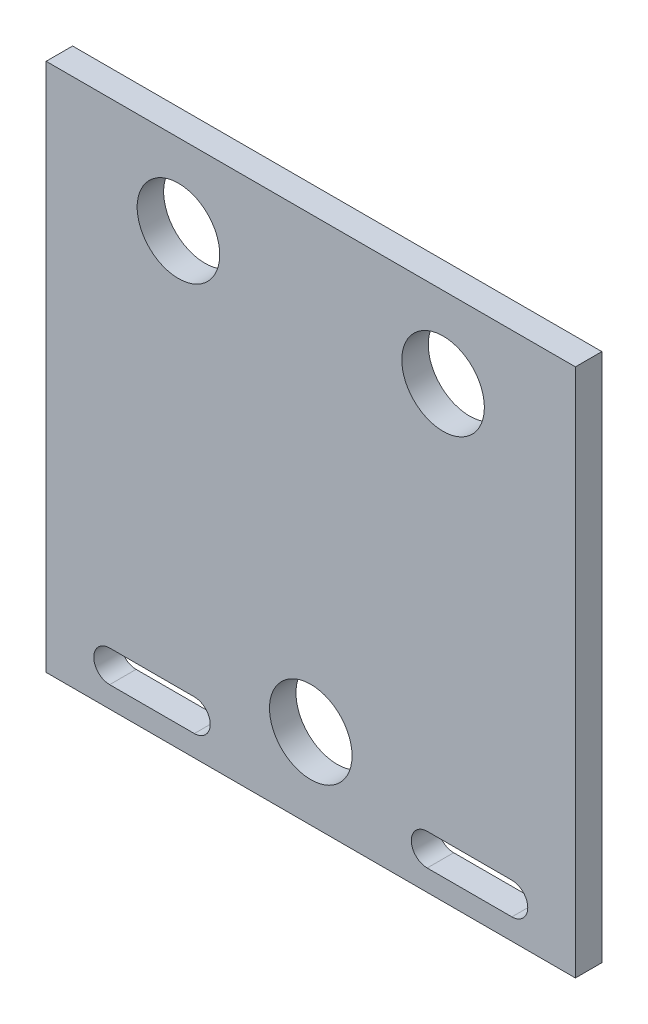
ISO-10303-21;
HEADER;
FILE_DESCRIPTION(('STEP AP214'),'2;1');
FILE_NAME('part.step','',(''),(''),'','','');
FILE_SCHEMA(('AUTOMOTIVE_DESIGN { 1 0 10303 214 1 1 1 1 }'));
ENDSEC;
DATA;
#1=APPLICATION_CONTEXT('core data for automotive mechanical design processes');
#2=APPLICATION_PROTOCOL_DEFINITION('international standard','automotive_design',2000,#1);
#3=PRODUCT_CONTEXT('',#1,'mechanical');
#4=PRODUCT('Part','Part','',(#3));
#5=PRODUCT_RELATED_PRODUCT_CATEGORY('part','',(#4));
#6=PRODUCT_DEFINITION_FORMATION('','',#4);
#7=PRODUCT_DEFINITION_CONTEXT('part definition',#1,'design');
#8=PRODUCT_DEFINITION('design','',#6,#7);
#9=PRODUCT_DEFINITION_SHAPE('','',#8);
#10=(LENGTH_UNIT() NAMED_UNIT(*) SI_UNIT(.MILLI.,.METRE.));
#11=(NAMED_UNIT(*) PLANE_ANGLE_UNIT() SI_UNIT($,.RADIAN.));
#12=(NAMED_UNIT(*) SI_UNIT($,.STERADIAN.) SOLID_ANGLE_UNIT());
#13=UNCERTAINTY_MEASURE_WITH_UNIT(LENGTH_MEASURE(1.E-05),#10,'distance_accuracy_value','');
#14=(GEOMETRIC_REPRESENTATION_CONTEXT(3) GLOBAL_UNCERTAINTY_ASSIGNED_CONTEXT((#13)) GLOBAL_UNIT_ASSIGNED_CONTEXT((#10,
#11,#12)) REPRESENTATION_CONTEXT('',''));
#15=CARTESIAN_POINT('',(0.,0.,0.));
#16=DIRECTION('',(0.,0.,1.));
#17=DIRECTION('',(1.,0.,0.));
#18=AXIS2_PLACEMENT_3D('',#15,#16,#17);
#19=CARTESIAN_POINT('',(0.,0.,3.175));
#20=DIRECTION('',(0.,0.,1.));
#21=DIRECTION('',(1.,0.,0.));
#22=AXIS2_PLACEMENT_3D('',#19,#20,#21);
#23=PLANE('',#22);
#24=CARTESIAN_POINT('',(15.875,22.06498,3.175));
#25=DIRECTION('',(0.,0.,1.));
#26=DIRECTION('',(1.,0.,0.));
#27=AXIS2_PLACEMENT_3D('',#24,#25,#26);
#28=CIRCLE('',#27,4.953);
#29=CARTESIAN_POINT('',(20.828,22.06498,3.175));
#30=VERTEX_POINT('',#29);
#31=EDGE_CURVE('E228',#30,#30,#28,.T.);
#32=ORIENTED_EDGE('',*,*,#31,.F.);
#33=EDGE_LOOP('',(#32));
#34=FACE_BOUND('',#33,.T.);
#35=DIRECTION('',(0.,-1.,0.));
#36=VECTOR('',#35,1.);
#37=CARTESIAN_POINT('',(-31.75,31.75,3.175));
#38=LINE('',#37,#36);
#39=CARTESIAN_POINT('',(-31.75,31.75,3.175));
#40=VERTEX_POINT('',#39);
#41=CARTESIAN_POINT('',(-31.75,-31.75,3.175));
#42=VERTEX_POINT('',#41);
#43=EDGE_CURVE('E244',#40,#42,#38,.T.);
#44=ORIENTED_EDGE('',*,*,#43,.T.);
#45=DIRECTION('',(1.,0.,0.));
#46=VECTOR('',#45,1.);
#47=CARTESIAN_POINT('',(-31.75,-31.75,3.175));
#48=LINE('',#47,#46);
#49=CARTESIAN_POINT('',(31.75,-31.75,3.175));
#50=VERTEX_POINT('',#49);
#51=EDGE_CURVE('E248',#42,#50,#48,.T.);
#52=ORIENTED_EDGE('',*,*,#51,.T.);
#53=DIRECTION('',(0.,1.,0.));
#54=VECTOR('',#53,1.);
#55=CARTESIAN_POINT('',(31.75,31.75,3.175));
#56=LINE('',#55,#54);
#57=CARTESIAN_POINT('',(31.75,31.75,3.175));
#58=VERTEX_POINT('',#57);
#59=EDGE_CURVE('E252',#50,#58,#56,.T.);
#60=ORIENTED_EDGE('',*,*,#59,.T.);
#61=DIRECTION('',(-1.,0.,0.));
#62=VECTOR('',#61,1.);
#63=CARTESIAN_POINT('',(-31.75,31.75,3.175));
#64=LINE('',#63,#62);
#65=EDGE_CURVE('E255',#58,#40,#64,.T.);
#66=ORIENTED_EDGE('',*,*,#65,.T.);
#67=EDGE_LOOP('',(#44,#52,#60,#66));
#68=FACE_BOUND('',#67,.T.);
#69=CARTESIAN_POINT('',(-15.875,22.06498,3.175));
#70=DIRECTION('',(0.,0.,1.));
#71=DIRECTION('',(1.,0.,0.));
#72=AXIS2_PLACEMENT_3D('',#69,#70,#71);
#73=CIRCLE('',#72,4.953);
#74=CARTESIAN_POINT('',(-10.922,22.06498,3.175));
#75=VERTEX_POINT('',#74);
#76=EDGE_CURVE('E236',#75,#75,#73,.T.);
#77=ORIENTED_EDGE('',*,*,#76,.F.);
#78=EDGE_LOOP('',(#77));
#79=FACE_BOUND('',#78,.T.);
#80=CARTESIAN_POINT('',(0.,-22.06498,3.175));
#81=DIRECTION('',(0.,0.,1.));
#82=DIRECTION('',(1.,0.,0.));
#83=AXIS2_PLACEMENT_3D('',#80,#81,#82);
#84=CIRCLE('',#83,4.953);
#85=CARTESIAN_POINT('',(4.953,-22.06498,3.175));
#86=VERTEX_POINT('',#85);
#87=EDGE_CURVE('E220',#86,#86,#84,.T.);
#88=ORIENTED_EDGE('',*,*,#87,.F.);
#89=EDGE_LOOP('',(#88));
#90=FACE_BOUND('',#89,.T.);
#91=DIRECTION('',(1.,0.,0.));
#92=VECTOR('',#91,1.);
#93=CARTESIAN_POINT('',(13.97,-29.21,3.175));
#94=LINE('',#93,#92);
#95=CARTESIAN_POINT('',(13.97,-29.21,3.175));
#96=VERTEX_POINT('',#95);
#97=CARTESIAN_POINT('',(24.13,-29.21,3.175));
#98=VERTEX_POINT('',#97);
#99=EDGE_CURVE('E180',#96,#98,#94,.T.);
#100=ORIENTED_EDGE('',*,*,#99,.F.);
#101=CARTESIAN_POINT('',(13.97,-27.305,3.175));
#102=DIRECTION('',(0.,0.,1.));
#103=DIRECTION('',(1.,0.,0.));
#104=AXIS2_PLACEMENT_3D('',#101,#102,#103);
#105=CIRCLE('',#104,1.905);
#106=CARTESIAN_POINT('',(13.97,-25.4,3.175));
#107=VERTEX_POINT('',#106);
#108=EDGE_CURVE('E177',#107,#96,#105,.T.);
#109=ORIENTED_EDGE('',*,*,#108,.F.);
#110=DIRECTION('',(-1.,0.,0.));
#111=VECTOR('',#110,1.);
#112=CARTESIAN_POINT('',(13.97,-25.4,3.175));
#113=LINE('',#112,#111);
#114=CARTESIAN_POINT('',(24.13,-25.4,3.175));
#115=VERTEX_POINT('',#114);
#116=EDGE_CURVE('E188',#115,#107,#113,.T.);
#117=ORIENTED_EDGE('',*,*,#116,.F.);
#118=CARTESIAN_POINT('',(24.13,-27.305,3.175));
#119=DIRECTION('',(0.,0.,1.));
#120=DIRECTION('',(1.,0.,0.));
#121=AXIS2_PLACEMENT_3D('',#118,#119,#120);
#122=CIRCLE('',#121,1.905);
#123=EDGE_CURVE('E184',#98,#115,#122,.T.);
#124=ORIENTED_EDGE('',*,*,#123,.F.);
#125=EDGE_LOOP('',(#100,#109,#117,#124));
#126=FACE_BOUND('',#125,.T.);
#127=DIRECTION('',(-1.,0.,0.));
#128=VECTOR('',#127,1.);
#129=CARTESIAN_POINT('',(-13.97,-25.4,3.175));
#130=LINE('',#129,#128);
#131=CARTESIAN_POINT('',(-13.97,-25.4,3.175));
#132=VERTEX_POINT('',#131);
#133=CARTESIAN_POINT('',(-24.13,-25.4,3.175));
#134=VERTEX_POINT('',#133);
#135=EDGE_CURVE('E138',#132,#134,#130,.T.);
#136=ORIENTED_EDGE('',*,*,#135,.F.);
#137=CARTESIAN_POINT('',(-13.97,-27.305,3.175));
#138=DIRECTION('',(0.,0.,1.));
#139=DIRECTION('',(-1.,0.,0.));
#140=AXIS2_PLACEMENT_3D('',#137,#138,#139);
#141=CIRCLE('',#140,1.90499999999998);
#142=CARTESIAN_POINT('',(-13.97,-29.21,3.175));
#143=VERTEX_POINT('',#142);
#144=EDGE_CURVE('E129',#143,#132,#141,.T.);
#145=ORIENTED_EDGE('',*,*,#144,.F.);
#146=DIRECTION('',(1.,0.,0.));
#147=VECTOR('',#146,1.);
#148=CARTESIAN_POINT('',(-13.97,-29.21,3.175));
#149=LINE('',#148,#147);
#150=CARTESIAN_POINT('',(-24.13,-29.21,3.175));
#151=VERTEX_POINT('',#150);
#152=EDGE_CURVE('E155',#151,#143,#149,.T.);
#153=ORIENTED_EDGE('',*,*,#152,.F.);
#154=CARTESIAN_POINT('',(-24.13,-27.305,3.175));
#155=DIRECTION('',(0.,0.,1.));
#156=DIRECTION('',(-1.,0.,0.));
#157=AXIS2_PLACEMENT_3D('',#154,#155,#156);
#158=CIRCLE('',#157,1.90499999999998);
#159=EDGE_CURVE('E151',#134,#151,#158,.T.);
#160=ORIENTED_EDGE('',*,*,#159,.F.);
#161=EDGE_LOOP('',(#136,#145,#153,#160));
#162=FACE_BOUND('',#161,.T.);
#163=ADVANCED_FACE('F39',(#34,#68,#79,#90,#126,#162),#23,.T.);
#164=CARTESIAN_POINT('',(0.,0.,0.));
#165=DIRECTION('',(0.,0.,1.));
#166=DIRECTION('',(1.,0.,0.));
#167=AXIS2_PLACEMENT_3D('',#164,#165,#166);
#168=PLANE('',#167);
#169=CARTESIAN_POINT('',(13.97,-27.305,0.));
#170=DIRECTION('',(0.,0.,1.));
#171=DIRECTION('',(1.,0.,0.));
#172=AXIS2_PLACEMENT_3D('',#169,#170,#171);
#173=CIRCLE('',#172,1.905);
#174=CARTESIAN_POINT('',(13.97,-25.4,0.));
#175=VERTEX_POINT('',#174);
#176=CARTESIAN_POINT('',(13.97,-29.21,0.));
#177=VERTEX_POINT('',#176);
#178=EDGE_CURVE('E147',#175,#177,#173,.T.);
#179=ORIENTED_EDGE('',*,*,#178,.T.);
#180=DIRECTION('',(1.,0.,0.));
#181=VECTOR('',#180,1.);
#182=CARTESIAN_POINT('',(13.97,-29.21,0.));
#183=LINE('',#182,#181);
#184=CARTESIAN_POINT('',(24.13,-29.21,0.));
#185=VERTEX_POINT('',#184);
#186=EDGE_CURVE('E195',#177,#185,#183,.T.);
#187=ORIENTED_EDGE('',*,*,#186,.T.);
#188=CARTESIAN_POINT('',(24.13,-27.305,0.));
#189=DIRECTION('',(0.,0.,1.));
#190=DIRECTION('',(1.,0.,0.));
#191=AXIS2_PLACEMENT_3D('',#188,#189,#190);
#192=CIRCLE('',#191,1.905);
#193=CARTESIAN_POINT('',(24.13,-25.4,0.));
#194=VERTEX_POINT('',#193);
#195=EDGE_CURVE('E199',#185,#194,#192,.T.);
#196=ORIENTED_EDGE('',*,*,#195,.T.);
#197=DIRECTION('',(-1.,0.,0.));
#198=VECTOR('',#197,1.);
#199=CARTESIAN_POINT('',(13.97,-25.4,0.));
#200=LINE('',#199,#198);
#201=EDGE_CURVE('E181',#194,#175,#200,.T.);
#202=ORIENTED_EDGE('',*,*,#201,.T.);
#203=EDGE_LOOP('',(#179,#187,#196,#202));
#204=FACE_BOUND('',#203,.T.);
#205=DIRECTION('',(0.,-1.,0.));
#206=VECTOR('',#205,1.);
#207=CARTESIAN_POINT('',(-31.75,31.75,0.));
#208=LINE('',#207,#206);
#209=CARTESIAN_POINT('',(-31.75,31.75,0.));
#210=VERTEX_POINT('',#209);
#211=CARTESIAN_POINT('',(-31.75,-31.75,0.));
#212=VERTEX_POINT('',#211);
#213=EDGE_CURVE('E240',#210,#212,#208,.T.);
#214=ORIENTED_EDGE('',*,*,#213,.F.);
#215=DIRECTION('',(-1.,0.,0.));
#216=VECTOR('',#215,1.);
#217=CARTESIAN_POINT('',(-31.75,31.75,0.));
#218=LINE('',#217,#216);
#219=CARTESIAN_POINT('',(31.75,31.75,0.));
#220=VERTEX_POINT('',#219);
#221=EDGE_CURVE('E249',#220,#210,#218,.T.);
#222=ORIENTED_EDGE('',*,*,#221,.F.);
#223=DIRECTION('',(0.,1.,0.));
#224=VECTOR('',#223,1.);
#225=CARTESIAN_POINT('',(31.75,31.75,0.));
#226=LINE('',#225,#224);
#227=CARTESIAN_POINT('',(31.75,-31.75,0.));
#228=VERTEX_POINT('',#227);
#229=EDGE_CURVE('E265',#228,#220,#226,.T.);
#230=ORIENTED_EDGE('',*,*,#229,.F.);
#231=DIRECTION('',(1.,0.,0.));
#232=VECTOR('',#231,1.);
#233=CARTESIAN_POINT('',(-31.75,-31.75,0.));
#234=LINE('',#233,#232);
#235=EDGE_CURVE('E262',#212,#228,#234,.T.);
#236=ORIENTED_EDGE('',*,*,#235,.F.);
#237=EDGE_LOOP('',(#214,#222,#230,#236));
#238=FACE_BOUND('',#237,.T.);
#239=CARTESIAN_POINT('',(-15.875,22.06498,0.));
#240=DIRECTION('',(0.,0.,1.));
#241=DIRECTION('',(1.,0.,0.));
#242=AXIS2_PLACEMENT_3D('',#239,#240,#241);
#243=CIRCLE('',#242,4.953);
#244=CARTESIAN_POINT('',(-10.922,22.06498,0.));
#245=VERTEX_POINT('',#244);
#246=EDGE_CURVE('E232',#245,#245,#243,.T.);
#247=ORIENTED_EDGE('',*,*,#246,.T.);
#248=EDGE_LOOP('',(#247));
#249=FACE_BOUND('',#248,.T.);
#250=CARTESIAN_POINT('',(15.875,22.06498,0.));
#251=DIRECTION('',(0.,0.,1.));
#252=DIRECTION('',(1.,0.,0.));
#253=AXIS2_PLACEMENT_3D('',#250,#251,#252);
#254=CIRCLE('',#253,4.953);
#255=CARTESIAN_POINT('',(20.828,22.06498,0.));
#256=VERTEX_POINT('',#255);
#257=EDGE_CURVE('E224',#256,#256,#254,.T.);
#258=ORIENTED_EDGE('',*,*,#257,.T.);
#259=EDGE_LOOP('',(#258));
#260=FACE_BOUND('',#259,.T.);
#261=CARTESIAN_POINT('',(0.,-22.06498,0.));
#262=DIRECTION('',(0.,0.,1.));
#263=DIRECTION('',(1.,0.,0.));
#264=AXIS2_PLACEMENT_3D('',#261,#262,#263);
#265=CIRCLE('',#264,4.953);
#266=CARTESIAN_POINT('',(4.953,-22.06498,0.));
#267=VERTEX_POINT('',#266);
#268=EDGE_CURVE('E219',#267,#267,#265,.T.);
#269=ORIENTED_EDGE('',*,*,#268,.T.);
#270=EDGE_LOOP('',(#269));
#271=FACE_BOUND('',#270,.T.);
#272=CARTESIAN_POINT('',(-13.97,-27.305,0.));
#273=DIRECTION('',(0.,0.,1.));
#274=DIRECTION('',(-1.,0.,0.));
#275=AXIS2_PLACEMENT_3D('',#272,#273,#274);
#276=CIRCLE('',#275,1.90499999999998);
#277=CARTESIAN_POINT('',(-13.97,-29.21,0.));
#278=VERTEX_POINT('',#277);
#279=CARTESIAN_POINT('',(-13.97,-25.4,0.));
#280=VERTEX_POINT('',#279);
#281=EDGE_CURVE('E63',#278,#280,#276,.T.);
#282=ORIENTED_EDGE('',*,*,#281,.T.);
#283=DIRECTION('',(-1.,0.,0.));
#284=VECTOR('',#283,1.);
#285=CARTESIAN_POINT('',(-13.97,-25.4,0.));
#286=LINE('',#285,#284);
#287=CARTESIAN_POINT('',(-24.13,-25.4,0.));
#288=VERTEX_POINT('',#287);
#289=EDGE_CURVE('E145',#280,#288,#286,.T.);
#290=ORIENTED_EDGE('',*,*,#289,.T.);
#291=CARTESIAN_POINT('',(-24.13,-27.305,0.));
#292=DIRECTION('',(0.,0.,1.));
#293=DIRECTION('',(-1.,0.,0.));
#294=AXIS2_PLACEMENT_3D('',#291,#292,#293);
#295=CIRCLE('',#294,1.90499999999998);
#296=CARTESIAN_POINT('',(-24.13,-29.21,0.));
#297=VERTEX_POINT('',#296);
#298=EDGE_CURVE('E164',#288,#297,#295,.T.);
#299=ORIENTED_EDGE('',*,*,#298,.T.);
#300=DIRECTION('',(1.,0.,0.));
#301=VECTOR('',#300,1.);
#302=CARTESIAN_POINT('',(-13.97,-29.21,0.));
#303=LINE('',#302,#301);
#304=EDGE_CURVE('E139',#297,#278,#303,.T.);
#305=ORIENTED_EDGE('',*,*,#304,.T.);
#306=EDGE_LOOP('',(#282,#290,#299,#305));
#307=FACE_BOUND('',#306,.T.);
#308=ADVANCED_FACE('F288',(#204,#238,#249,#260,#271,#307),#168,.F.);
#309=CARTESIAN_POINT('',(-31.75,31.75,3.175));
#310=DIRECTION('',(1.,0.,0.));
#311=DIRECTION('',(0.,0.,-1.));
#312=AXIS2_PLACEMENT_3D('',#309,#310,#311);
#313=PLANE('',#312);
#314=ORIENTED_EDGE('',*,*,#213,.T.);
#315=DIRECTION('',(0.,0.,-1.));
#316=VECTOR('',#315,1.);
#317=CARTESIAN_POINT('',(-31.75,-31.75,3.175));
#318=LINE('',#317,#316);
#319=EDGE_CURVE('E11',#42,#212,#318,.T.);
#320=ORIENTED_EDGE('',*,*,#319,.F.);
#321=ORIENTED_EDGE('',*,*,#43,.F.);
#322=DIRECTION('',(0.,0.,-1.));
#323=VECTOR('',#322,1.);
#324=CARTESIAN_POINT('',(-31.75,31.75,3.175));
#325=LINE('',#324,#323);
#326=EDGE_CURVE('E258',#40,#210,#325,.T.);
#327=ORIENTED_EDGE('',*,*,#326,.T.);
#328=EDGE_LOOP('',(#314,#320,#321,#327));
#329=FACE_BOUND('',#328,.T.);
#330=ADVANCED_FACE('F41',(#329),#313,.F.);
#331=CARTESIAN_POINT('',(-31.75,-31.75,3.175));
#332=DIRECTION('',(0.,1.,0.));
#333=DIRECTION('',(0.,0.,1.));
#334=AXIS2_PLACEMENT_3D('',#331,#332,#333);
#335=PLANE('',#334);
#336=ORIENTED_EDGE('',*,*,#235,.T.);
#337=DIRECTION('',(0.,0.,-1.));
#338=VECTOR('',#337,1.);
#339=CARTESIAN_POINT('',(31.75,-31.75,3.175));
#340=LINE('',#339,#338);
#341=EDGE_CURVE('E48',#50,#228,#340,.T.);
#342=ORIENTED_EDGE('',*,*,#341,.F.);
#343=ORIENTED_EDGE('',*,*,#51,.F.);
#344=ORIENTED_EDGE('',*,*,#319,.T.);
#345=EDGE_LOOP('',(#336,#342,#343,#344));
#346=FACE_BOUND('',#345,.T.);
#347=ADVANCED_FACE('F299',(#346),#335,.F.);
#348=CARTESIAN_POINT('',(31.75,31.75,3.175));
#349=DIRECTION('',(-1.,0.,0.));
#350=DIRECTION('',(0.,0.,1.));
#351=AXIS2_PLACEMENT_3D('',#348,#349,#350);
#352=PLANE('',#351);
#353=ORIENTED_EDGE('',*,*,#229,.T.);
#354=DIRECTION('',(0.,0.,-1.));
#355=VECTOR('',#354,1.);
#356=CARTESIAN_POINT('',(31.75,31.75,3.175));
#357=LINE('',#356,#355);
#358=EDGE_CURVE('E273',#58,#220,#357,.T.);
#359=ORIENTED_EDGE('',*,*,#358,.F.);
#360=ORIENTED_EDGE('',*,*,#59,.F.);
#361=ORIENTED_EDGE('',*,*,#341,.T.);
#362=EDGE_LOOP('',(#353,#359,#360,#361));
#363=FACE_BOUND('',#362,.T.);
#364=ADVANCED_FACE('F282',(#363),#352,.F.);
#365=CARTESIAN_POINT('',(-31.75,31.75,3.175));
#366=DIRECTION('',(0.,-1.,0.));
#367=DIRECTION('',(0.,0.,-1.));
#368=AXIS2_PLACEMENT_3D('',#365,#366,#367);
#369=PLANE('',#368);
#370=ORIENTED_EDGE('',*,*,#221,.T.);
#371=ORIENTED_EDGE('',*,*,#326,.F.);
#372=ORIENTED_EDGE('',*,*,#65,.F.);
#373=ORIENTED_EDGE('',*,*,#358,.T.);
#374=EDGE_LOOP('',(#370,#371,#372,#373));
#375=FACE_BOUND('',#374,.T.);
#376=ADVANCED_FACE('F292',(#375),#369,.F.);
#377=CARTESIAN_POINT('',(-15.875,22.06498,3.175));
#378=DIRECTION('',(0.,0.,-1.));
#379=DIRECTION('',(-1.,0.,0.));
#380=AXIS2_PLACEMENT_3D('',#377,#378,#379);
#381=CYLINDRICAL_SURFACE('',#380,4.953);
#382=ORIENTED_EDGE('',*,*,#76,.T.);
#383=EDGE_LOOP('',(#382));
#384=FACE_BOUND('',#383,.T.);
#385=ORIENTED_EDGE('',*,*,#246,.F.);
#386=EDGE_LOOP('',(#385));
#387=FACE_BOUND('',#386,.T.);
#388=ADVANCED_FACE('F316',(#384,#387),#381,.F.);
#389=CARTESIAN_POINT('',(15.875,22.06498,3.175));
#390=DIRECTION('',(0.,0.,-1.));
#391=DIRECTION('',(-1.,0.,0.));
#392=AXIS2_PLACEMENT_3D('',#389,#390,#391);
#393=CYLINDRICAL_SURFACE('',#392,4.953);
#394=ORIENTED_EDGE('',*,*,#31,.T.);
#395=EDGE_LOOP('',(#394));
#396=FACE_BOUND('',#395,.T.);
#397=ORIENTED_EDGE('',*,*,#257,.F.);
#398=EDGE_LOOP('',(#397));
#399=FACE_BOUND('',#398,.T.);
#400=ADVANCED_FACE('F323',(#396,#399),#393,.F.);
#401=CARTESIAN_POINT('',(0.,-22.06498,3.175));
#402=DIRECTION('',(0.,0.,-1.));
#403=DIRECTION('',(-1.,0.,0.));
#404=AXIS2_PLACEMENT_3D('',#401,#402,#403);
#405=CYLINDRICAL_SURFACE('',#404,4.953);
#406=ORIENTED_EDGE('',*,*,#87,.T.);
#407=EDGE_LOOP('',(#406));
#408=FACE_BOUND('',#407,.T.);
#409=ORIENTED_EDGE('',*,*,#268,.F.);
#410=EDGE_LOOP('',(#409));
#411=FACE_BOUND('',#410,.T.);
#412=ADVANCED_FACE('F328',(#408,#411),#405,.F.);
#413=CARTESIAN_POINT('',(13.97,-27.305,3.175));
#414=DIRECTION('',(0.,0.,-1.));
#415=DIRECTION('',(-1.,0.,0.));
#416=AXIS2_PLACEMENT_3D('',#413,#414,#415);
#417=CYLINDRICAL_SURFACE('',#416,1.905);
#418=ORIENTED_EDGE('',*,*,#178,.F.);
#419=DIRECTION('',(0.,0.,-1.));
#420=VECTOR('',#419,1.);
#421=CARTESIAN_POINT('',(13.97,-25.4,3.175));
#422=LINE('',#421,#420);
#423=EDGE_CURVE('E191',#107,#175,#422,.T.);
#424=ORIENTED_EDGE('',*,*,#423,.F.);
#425=ORIENTED_EDGE('',*,*,#108,.T.);
#426=DIRECTION('',(0.,0.,-1.));
#427=VECTOR('',#426,1.);
#428=CARTESIAN_POINT('',(13.97,-29.21,3.175));
#429=LINE('',#428,#427);
#430=EDGE_CURVE('E215',#96,#177,#429,.T.);
#431=ORIENTED_EDGE('',*,*,#430,.T.);
#432=EDGE_LOOP('',(#418,#424,#425,#431));
#433=FACE_BOUND('',#432,.T.);
#434=ADVANCED_FACE('F364',(#433),#417,.F.);
#435=CARTESIAN_POINT('',(13.97,-29.21,3.175));
#436=DIRECTION('',(0.,1.,0.));
#437=DIRECTION('',(-1.,0.,0.));
#438=AXIS2_PLACEMENT_3D('',#435,#436,#437);
#439=PLANE('',#438);
#440=ORIENTED_EDGE('',*,*,#186,.F.);
#441=ORIENTED_EDGE('',*,*,#430,.F.);
#442=ORIENTED_EDGE('',*,*,#99,.T.);
#443=DIRECTION('',(0.,0.,-1.));
#444=VECTOR('',#443,1.);
#445=CARTESIAN_POINT('',(24.13,-29.21,3.175));
#446=LINE('',#445,#444);
#447=EDGE_CURVE('E212',#98,#185,#446,.T.);
#448=ORIENTED_EDGE('',*,*,#447,.T.);
#449=EDGE_LOOP('',(#440,#441,#442,#448));
#450=FACE_BOUND('',#449,.T.);
#451=ADVANCED_FACE('F360',(#450),#439,.T.);
#452=CARTESIAN_POINT('',(24.13,-27.305,3.175));
#453=DIRECTION('',(0.,0.,-1.));
#454=DIRECTION('',(-1.,0.,0.));
#455=AXIS2_PLACEMENT_3D('',#452,#453,#454);
#456=CYLINDRICAL_SURFACE('',#455,1.905);
#457=ORIENTED_EDGE('',*,*,#195,.F.);
#458=ORIENTED_EDGE('',*,*,#447,.F.);
#459=ORIENTED_EDGE('',*,*,#123,.T.);
#460=DIRECTION('',(0.,0.,-1.));
#461=VECTOR('',#460,1.);
#462=CARTESIAN_POINT('',(24.13,-25.4,3.175));
#463=LINE('',#462,#461);
#464=EDGE_CURVE('E209',#115,#194,#463,.T.);
#465=ORIENTED_EDGE('',*,*,#464,.T.);
#466=EDGE_LOOP('',(#457,#458,#459,#465));
#467=FACE_BOUND('',#466,.T.);
#468=ADVANCED_FACE('F356',(#467),#456,.F.);
#469=CARTESIAN_POINT('',(13.97,-25.4,3.175));
#470=DIRECTION('',(0.,-1.,0.));
#471=DIRECTION('',(1.,0.,0.));
#472=AXIS2_PLACEMENT_3D('',#469,#470,#471);
#473=PLANE('',#472);
#474=ORIENTED_EDGE('',*,*,#201,.F.);
#475=ORIENTED_EDGE('',*,*,#464,.F.);
#476=ORIENTED_EDGE('',*,*,#116,.T.);
#477=ORIENTED_EDGE('',*,*,#423,.T.);
#478=EDGE_LOOP('',(#474,#475,#476,#477));
#479=FACE_BOUND('',#478,.T.);
#480=ADVANCED_FACE('F353',(#479),#473,.T.);
#481=CARTESIAN_POINT('',(-13.97,-27.305,3.175));
#482=DIRECTION('',(0.,0.,-1.));
#483=DIRECTION('',(-1.,0.,0.));
#484=AXIS2_PLACEMENT_3D('',#481,#482,#483);
#485=CYLINDRICAL_SURFACE('',#484,1.90499999999998);
#486=ORIENTED_EDGE('',*,*,#281,.F.);
#487=DIRECTION('',(0.,0.,-1.));
#488=VECTOR('',#487,1.);
#489=CARTESIAN_POINT('',(-13.97,-29.21,3.175));
#490=LINE('',#489,#488);
#491=EDGE_CURVE('E133',#143,#278,#490,.T.);
#492=ORIENTED_EDGE('',*,*,#491,.F.);
#493=ORIENTED_EDGE('',*,*,#144,.T.);
#494=DIRECTION('',(0.,0.,-1.));
#495=VECTOR('',#494,1.);
#496=CARTESIAN_POINT('',(-13.97,-25.4,3.175));
#497=LINE('',#496,#495);
#498=EDGE_CURVE('E132',#132,#280,#497,.T.);
#499=ORIENTED_EDGE('',*,*,#498,.T.);
#500=EDGE_LOOP('',(#486,#492,#493,#499));
#501=FACE_BOUND('',#500,.T.);
#502=ADVANCED_FACE('F131',(#501),#485,.F.);
#503=CARTESIAN_POINT('',(-13.97,-25.4,3.175));
#504=DIRECTION('',(0.,-1.,0.));
#505=DIRECTION('',(0.,0.,-1.));
#506=AXIS2_PLACEMENT_3D('',#503,#504,#505);
#507=PLANE('',#506);
#508=ORIENTED_EDGE('',*,*,#289,.F.);
#509=ORIENTED_EDGE('',*,*,#498,.F.);
#510=ORIENTED_EDGE('',*,*,#135,.T.);
#511=DIRECTION('',(0.,0.,-1.));
#512=VECTOR('',#511,1.);
#513=CARTESIAN_POINT('',(-24.13,-25.4,3.175));
#514=LINE('',#513,#512);
#515=EDGE_CURVE('E148',#134,#288,#514,.T.);
#516=ORIENTED_EDGE('',*,*,#515,.T.);
#517=EDGE_LOOP('',(#508,#509,#510,#516));
#518=FACE_BOUND('',#517,.T.);
#519=ADVANCED_FACE('F142',(#518),#507,.T.);
#520=CARTESIAN_POINT('',(-24.13,-27.305,3.175));
#521=DIRECTION('',(0.,0.,-1.));
#522=DIRECTION('',(-1.,0.,0.));
#523=AXIS2_PLACEMENT_3D('',#520,#521,#522);
#524=CYLINDRICAL_SURFACE('',#523,1.90499999999998);
#525=ORIENTED_EDGE('',*,*,#298,.F.);
#526=ORIENTED_EDGE('',*,*,#515,.F.);
#527=ORIENTED_EDGE('',*,*,#159,.T.);
#528=DIRECTION('',(0.,0.,-1.));
#529=VECTOR('',#528,1.);
#530=CARTESIAN_POINT('',(-24.13,-29.21,3.175));
#531=LINE('',#530,#529);
#532=EDGE_CURVE('E55',#151,#297,#531,.T.);
#533=ORIENTED_EDGE('',*,*,#532,.T.);
#534=EDGE_LOOP('',(#525,#526,#527,#533));
#535=FACE_BOUND('',#534,.T.);
#536=ADVANCED_FACE('F341',(#535),#524,.F.);
#537=CARTESIAN_POINT('',(-13.97,-29.21,3.175));
#538=DIRECTION('',(0.,1.,0.));
#539=DIRECTION('',(-1.,0.,0.));
#540=AXIS2_PLACEMENT_3D('',#537,#538,#539);
#541=PLANE('',#540);
#542=ORIENTED_EDGE('',*,*,#304,.F.);
#543=ORIENTED_EDGE('',*,*,#532,.F.);
#544=ORIENTED_EDGE('',*,*,#152,.T.);
#545=ORIENTED_EDGE('',*,*,#491,.T.);
#546=EDGE_LOOP('',(#542,#543,#544,#545));
#547=FACE_BOUND('',#546,.T.);
#548=ADVANCED_FACE('F339',(#547),#541,.T.);
#549=CLOSED_SHELL('',(#163,#308,#330,#347,#364,#376,#388,#400,#412,#434,#451,#468,#480,#502,
#519,#536,#548));
#550=MANIFOLD_SOLID_BREP('B2',#549);
#551=ADVANCED_BREP_SHAPE_REPRESENTATION('',(#18,#550),#14);
#552=SHAPE_DEFINITION_REPRESENTATION(#9,#551);
ENDSEC;
END-ISO-10303-21;
